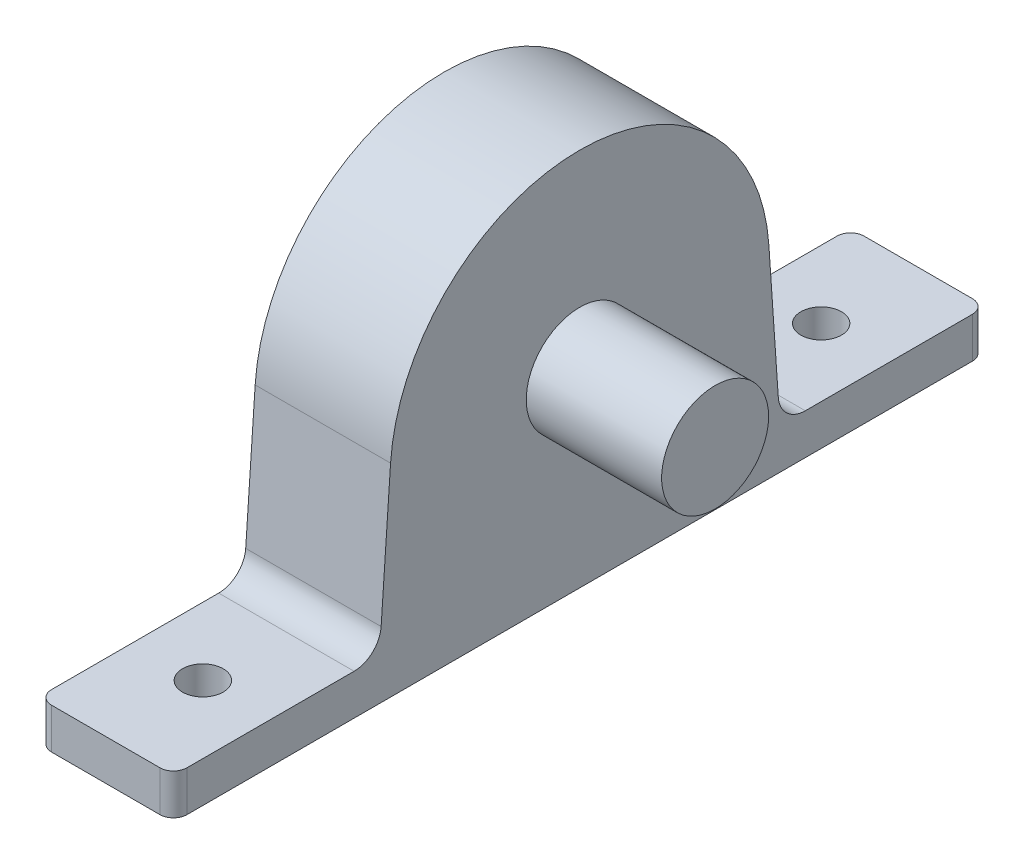
ISO-10303-21;
HEADER;
FILE_DESCRIPTION(('STEP AP214'),'2;1');
FILE_NAME('part.step','',(''),(''),'','','');
FILE_SCHEMA(('AUTOMOTIVE_DESIGN { 1 0 10303 214 1 1 1 1 }'));
ENDSEC;
DATA;
#1=APPLICATION_CONTEXT('core data for automotive mechanical design processes');
#2=APPLICATION_PROTOCOL_DEFINITION('international standard','automotive_design',2000,#1);
#3=PRODUCT_CONTEXT('',#1,'mechanical');
#4=PRODUCT('Part','Part','',(#3));
#5=PRODUCT_RELATED_PRODUCT_CATEGORY('part','',(#4));
#6=PRODUCT_DEFINITION_FORMATION('','',#4);
#7=PRODUCT_DEFINITION_CONTEXT('part definition',#1,'design');
#8=PRODUCT_DEFINITION('design','',#6,#7);
#9=PRODUCT_DEFINITION_SHAPE('','',#8);
#10=(LENGTH_UNIT() NAMED_UNIT(*) SI_UNIT(.MILLI.,.METRE.));
#11=(NAMED_UNIT(*) PLANE_ANGLE_UNIT() SI_UNIT($,.RADIAN.));
#12=(NAMED_UNIT(*) SI_UNIT($,.STERADIAN.) SOLID_ANGLE_UNIT());
#13=UNCERTAINTY_MEASURE_WITH_UNIT(LENGTH_MEASURE(1.E-05),#10,'distance_accuracy_value','');
#14=(GEOMETRIC_REPRESENTATION_CONTEXT(3) GLOBAL_UNCERTAINTY_ASSIGNED_CONTEXT((#13)) GLOBAL_UNIT_ASSIGNED_CONTEXT((#10,
#11,#12)) REPRESENTATION_CONTEXT('',''));
#15=CARTESIAN_POINT('',(0.,0.,0.));
#16=DIRECTION('',(0.,0.,1.));
#17=DIRECTION('',(1.,0.,0.));
#18=AXIS2_PLACEMENT_3D('',#15,#16,#17);
#19=CARTESIAN_POINT('',(-41.0365690573664,1.03079987136159,14.9288257231679));
#20=DIRECTION('',(0.,-0.0688836104513062,-0.997624703087886));
#21=DIRECTION('',(0.,0.997624703087886,-0.0688836104513062));
#22=AXIS2_PLACEMENT_3D('',#19,#20,#21);
#23=PLANE('',#22);
#24=DIRECTION('',(0.,0.997624703087886,-0.0688836104513062));
#25=VECTOR('',#24,1.);
#26=CARTESIAN_POINT('',(0.,1.03079987136159,14.9288257231679));
#27=LINE('',#26,#25);
#28=CARTESIAN_POINT('',(0.,4.86223277909739,14.664274403348));
#29=VERTEX_POINT('',#28);
#30=CARTESIAN_POINT('',(0.,14.9643705463183,13.9667458432304));
#31=VERTEX_POINT('',#30);
#32=EDGE_CURVE('E131',#29,#31,#27,.T.);
#33=ORIENTED_EDGE('',*,*,#32,.F.);
#34=DIRECTION('',(-1.,0.,0.));
#35=VECTOR('',#34,1.);
#36=CARTESIAN_POINT('',(10.,4.86223277909739,14.664274403348));
#37=LINE('',#36,#35);
#38=CARTESIAN_POINT('',(10.,4.86223277909739,14.664274403348));
#39=VERTEX_POINT('',#38);
#40=EDGE_CURVE('E55',#29,#39,#37,.F.);
#41=ORIENTED_EDGE('',*,*,#40,.T.);
#42=DIRECTION('',(0.,0.997624703087886,-0.0688836104513062));
#43=VECTOR('',#42,1.);
#44=CARTESIAN_POINT('',(10.,1.03079987136159,14.9288257231679));
#45=LINE('',#44,#43);
#46=CARTESIAN_POINT('',(10.,14.9643705463183,13.9667458432304));
#47=VERTEX_POINT('',#46);
#48=EDGE_CURVE('E143',#39,#47,#45,.T.);
#49=ORIENTED_EDGE('',*,*,#48,.T.);
#50=DIRECTION('',(1.,0.,0.));
#51=VECTOR('',#50,1.);
#52=CARTESIAN_POINT('',(-41.0365690573664,14.9643705463183,13.9667458432304));
#53=LINE('',#52,#51);
#54=EDGE_CURVE('E142',#31,#47,#53,.T.);
#55=ORIENTED_EDGE('',*,*,#54,.F.);
#56=EDGE_LOOP('',(#33,#41,#49,#55));
#57=FACE_BOUND('',#56,.T.);
#58=ADVANCED_FACE('F34',(#57),#23,.F.);
#59=CARTESIAN_POINT('',(-41.0365690573664,1.03079987136159,-14.9288257231679));
#60=DIRECTION('',(0.,0.068883610451306,-0.997624703087886));
#61=DIRECTION('',(0.,0.997624703087886,0.068883610451306));
#62=AXIS2_PLACEMENT_3D('',#59,#60,#61);
#63=PLANE('',#62);
#64=DIRECTION('',(0.,0.997624703087886,0.068883610451306));
#65=VECTOR('',#64,1.);
#66=CARTESIAN_POINT('',(10.,1.03079987136159,-14.9288257231679));
#67=LINE('',#66,#65);
#68=CARTESIAN_POINT('',(10.,4.86223277909739,-14.664274403348));
#69=VERTEX_POINT('',#68);
#70=CARTESIAN_POINT('',(10.,14.9643705463183,-13.9667458432304));
#71=VERTEX_POINT('',#70);
#72=EDGE_CURVE('E138',#69,#71,#67,.T.);
#73=ORIENTED_EDGE('',*,*,#72,.F.);
#74=DIRECTION('',(-1.,0.,0.));
#75=VECTOR('',#74,1.);
#76=CARTESIAN_POINT('',(-41.0365690573664,4.86223277909739,-14.664274403348));
#77=LINE('',#76,#75);
#78=CARTESIAN_POINT('',(0.,4.86223277909739,-14.664274403348));
#79=VERTEX_POINT('',#78);
#80=EDGE_CURVE('E209',#69,#79,#77,.T.);
#81=ORIENTED_EDGE('',*,*,#80,.T.);
#82=DIRECTION('',(0.,0.997624703087886,0.068883610451306));
#83=VECTOR('',#82,1.);
#84=CARTESIAN_POINT('',(0.,1.03079987136159,-14.9288257231679));
#85=LINE('',#84,#83);
#86=CARTESIAN_POINT('',(0.,14.9643705463183,-13.9667458432304));
#87=VERTEX_POINT('',#86);
#88=EDGE_CURVE('E156',#79,#87,#85,.T.);
#89=ORIENTED_EDGE('',*,*,#88,.T.);
#90=DIRECTION('',(1.,0.,0.));
#91=VECTOR('',#90,1.);
#92=CARTESIAN_POINT('',(-41.0365690573664,14.9643705463183,-13.9667458432304));
#93=LINE('',#92,#91);
#94=EDGE_CURVE('E150',#87,#71,#93,.T.);
#95=ORIENTED_EDGE('',*,*,#94,.T.);
#96=EDGE_LOOP('',(#73,#81,#89,#95));
#97=FACE_BOUND('',#96,.T.);
#98=ADVANCED_FACE('F233',(#97),#63,.T.);
#99=CARTESIAN_POINT('',(10.,0.,15.));
#100=DIRECTION('',(0.,1.,0.));
#101=DIRECTION('',(0.,0.,1.));
#102=AXIS2_PLACEMENT_3D('',#99,#100,#101);
#103=PLANE('',#102);
#104=CARTESIAN_POINT('',(5.,0.,-22.8297619047619));
#105=DIRECTION('',(0.,1.,0.));
#106=DIRECTION('',(0.,0.,1.));
#107=AXIS2_PLACEMENT_3D('',#104,#105,#106);
#108=CIRCLE('',#107,1.5);
#109=CARTESIAN_POINT('',(5.,0.,-21.3297619047619));
#110=VERTEX_POINT('',#109);
#111=EDGE_CURVE('E260',#110,#110,#108,.T.);
#112=ORIENTED_EDGE('',*,*,#111,.T.);
#113=EDGE_LOOP('',(#112));
#114=FACE_BOUND('',#113,.T.);
#115=CARTESIAN_POINT('',(5.,0.,22.8297619047619));
#116=DIRECTION('',(0.,1.,0.));
#117=DIRECTION('',(0.,0.,1.));
#118=AXIS2_PLACEMENT_3D('',#115,#116,#117);
#119=CIRCLE('',#118,1.5);
#120=CARTESIAN_POINT('',(5.,0.,24.3297619047619));
#121=VERTEX_POINT('',#120);
#122=EDGE_CURVE('E270',#121,#121,#119,.T.);
#123=ORIENTED_EDGE('',*,*,#122,.T.);
#124=EDGE_LOOP('',(#123));
#125=FACE_BOUND('',#124,.T.);
#126=DIRECTION('',(0.,0.,-1.));
#127=VECTOR('',#126,1.);
#128=CARTESIAN_POINT('',(0.,0.,15.));
#129=LINE('',#128,#127);
#130=CARTESIAN_POINT('',(0.,0.,29.));
#131=VERTEX_POINT('',#130);
#132=CARTESIAN_POINT('',(0.,0.,-29.));
#133=VERTEX_POINT('',#132);
#134=EDGE_CURVE('E162',#131,#133,#129,.T.);
#135=ORIENTED_EDGE('',*,*,#134,.T.);
#136=CARTESIAN_POINT('',(1.,0.,-29.));
#137=DIRECTION('',(0.,1.,0.));
#138=DIRECTION('',(0.,0.,1.));
#139=AXIS2_PLACEMENT_3D('',#136,#137,#138);
#140=CIRCLE('',#139,1.);
#141=CARTESIAN_POINT('',(1.,0.,-30.));
#142=VERTEX_POINT('',#141);
#143=EDGE_CURVE('E182',#133,#142,#140,.F.);
#144=ORIENTED_EDGE('',*,*,#143,.T.);
#145=DIRECTION('',(1.,0.,0.));
#146=VECTOR('',#145,1.);
#147=CARTESIAN_POINT('',(0.,0.,-30.));
#148=LINE('',#147,#146);
#149=CARTESIAN_POINT('',(9.,0.,-30.));
#150=VERTEX_POINT('',#149);
#151=EDGE_CURVE('E247',#142,#150,#148,.T.);
#152=ORIENTED_EDGE('',*,*,#151,.T.);
#153=CARTESIAN_POINT('',(9.,0.,-29.));
#154=DIRECTION('',(0.,1.,0.));
#155=DIRECTION('',(0.,0.,1.));
#156=AXIS2_PLACEMENT_3D('',#153,#154,#155);
#157=CIRCLE('',#156,1.);
#158=CARTESIAN_POINT('',(10.,0.,-29.));
#159=VERTEX_POINT('',#158);
#160=EDGE_CURVE('E176',#150,#159,#157,.F.);
#161=ORIENTED_EDGE('',*,*,#160,.T.);
#162=DIRECTION('',(0.,0.,-1.));
#163=VECTOR('',#162,1.);
#164=CARTESIAN_POINT('',(10.,0.,15.));
#165=LINE('',#164,#163);
#166=CARTESIAN_POINT('',(10.,0.,29.));
#167=VERTEX_POINT('',#166);
#168=EDGE_CURVE('E167',#167,#159,#165,.T.);
#169=ORIENTED_EDGE('',*,*,#168,.F.);
#170=CARTESIAN_POINT('',(9.,0.,29.));
#171=DIRECTION('',(0.,1.,0.));
#172=DIRECTION('',(0.,0.,1.));
#173=AXIS2_PLACEMENT_3D('',#170,#171,#172);
#174=CIRCLE('',#173,1.);
#175=CARTESIAN_POINT('',(9.,0.,30.));
#176=VERTEX_POINT('',#175);
#177=EDGE_CURVE('E178',#167,#176,#174,.F.);
#178=ORIENTED_EDGE('',*,*,#177,.T.);
#179=DIRECTION('',(-1.,0.,0.));
#180=VECTOR('',#179,1.);
#181=CARTESIAN_POINT('',(0.,0.,30.));
#182=LINE('',#181,#180);
#183=CARTESIAN_POINT('',(1.,0.,30.));
#184=VERTEX_POINT('',#183);
#185=EDGE_CURVE('E243',#176,#184,#182,.T.);
#186=ORIENTED_EDGE('',*,*,#185,.T.);
#187=CARTESIAN_POINT('',(1.,0.,29.));
#188=DIRECTION('',(0.,1.,0.));
#189=DIRECTION('',(0.,0.,1.));
#190=AXIS2_PLACEMENT_3D('',#187,#188,#189);
#191=CIRCLE('',#190,1.);
#192=EDGE_CURVE('E180',#184,#131,#191,.F.);
#193=ORIENTED_EDGE('',*,*,#192,.T.);
#194=EDGE_LOOP('',(#135,#144,#152,#161,#169,#178,#186,#193));
#195=FACE_BOUND('',#194,.T.);
#196=ADVANCED_FACE('F307',(#114,#125,#195),#103,.F.);
#197=CARTESIAN_POINT('',(10.,14.,0.));
#198=DIRECTION('',(-1.,0.,0.));
#199=DIRECTION('',(0.,0.,1.));
#200=AXIS2_PLACEMENT_3D('',#197,#198,#199);
#201=PLANE('',#200);
#202=ORIENTED_EDGE('',*,*,#48,.F.);
#203=CARTESIAN_POINT('',(10.,5.,16.6595238095238));
#204=DIRECTION('',(-1.,0.,0.));
#205=DIRECTION('',(0.,0.,1.));
#206=AXIS2_PLACEMENT_3D('',#203,#204,#205);
#207=CIRCLE('',#206,2.);
#208=CARTESIAN_POINT('',(10.,3.,16.6595238095238));
#209=VERTEX_POINT('',#208);
#210=EDGE_CURVE('E11',#39,#209,#207,.T.);
#211=ORIENTED_EDGE('',*,*,#210,.T.);
#212=DIRECTION('',(0.,0.,1.));
#213=VECTOR('',#212,1.);
#214=CARTESIAN_POINT('',(10.,3.,30.));
#215=LINE('',#214,#213);
#216=CARTESIAN_POINT('',(10.,3.,29.));
#217=VERTEX_POINT('',#216);
#218=EDGE_CURVE('E255',#209,#217,#215,.T.);
#219=ORIENTED_EDGE('',*,*,#218,.T.);
#220=DIRECTION('',(0.,-1.,0.));
#221=VECTOR('',#220,1.);
#222=CARTESIAN_POINT('',(10.,0.,29.));
#223=LINE('',#222,#221);
#224=EDGE_CURVE('E206',#217,#167,#223,.T.);
#225=ORIENTED_EDGE('',*,*,#224,.T.);
#226=ORIENTED_EDGE('',*,*,#168,.T.);
#227=DIRECTION('',(0.,-1.,0.));
#228=VECTOR('',#227,1.);
#229=CARTESIAN_POINT('',(10.,3.,-29.));
#230=LINE('',#229,#228);
#231=CARTESIAN_POINT('',(10.,3.,-29.));
#232=VERTEX_POINT('',#231);
#233=EDGE_CURVE('E204',#159,#232,#230,.F.);
#234=ORIENTED_EDGE('',*,*,#233,.T.);
#235=CARTESIAN_POINT('',(10.,3.,-16.6595238095238));
#236=VERTEX_POINT('',#235);
#237=EDGE_CURVE('E228',#232,#236,#215,.T.);
#238=ORIENTED_EDGE('',*,*,#237,.T.);
#239=CARTESIAN_POINT('',(10.,5.,-16.6595238095238));
#240=DIRECTION('',(-1.,0.,0.));
#241=DIRECTION('',(0.,0.,1.));
#242=AXIS2_PLACEMENT_3D('',#239,#240,#241);
#243=CIRCLE('',#242,2.);
#244=EDGE_CURVE('E220',#236,#69,#243,.T.);
#245=ORIENTED_EDGE('',*,*,#244,.T.);
#246=ORIENTED_EDGE('',*,*,#72,.T.);
#247=CARTESIAN_POINT('',(10.,14.,0.));
#248=DIRECTION('',(1.,0.,0.));
#249=DIRECTION('',(0.,0.,-1.));
#250=AXIS2_PLACEMENT_3D('',#247,#248,#249);
#251=CIRCLE('',#250,14.);
#252=EDGE_CURVE('E151',#71,#47,#251,.T.);
#253=ORIENTED_EDGE('',*,*,#252,.T.);
#254=EDGE_LOOP('',(#202,#211,#219,#225,#226,#234,#238,#245,#246,#253));
#255=FACE_BOUND('',#254,.T.);
#256=CARTESIAN_POINT('',(10.,14.,0.));
#257=DIRECTION('',(1.,0.,0.));
#258=DIRECTION('',(0.,0.,-1.));
#259=AXIS2_PLACEMENT_3D('',#256,#257,#258);
#260=CIRCLE('',#259,3.95);
#261=CARTESIAN_POINT('',(10.,14.,-3.95));
#262=VERTEX_POINT('',#261);
#263=EDGE_CURVE('E163',#262,#262,#260,.T.);
#264=ORIENTED_EDGE('',*,*,#263,.F.);
#265=EDGE_LOOP('',(#264));
#266=FACE_BOUND('',#265,.T.);
#267=ADVANCED_FACE('F225',(#255,#266),#201,.F.);
#268=CARTESIAN_POINT('',(0.,14.,0.));
#269=DIRECTION('',(-1.,0.,0.));
#270=DIRECTION('',(0.,0.,1.));
#271=AXIS2_PLACEMENT_3D('',#268,#269,#270);
#272=PLANE('',#271);
#273=ORIENTED_EDGE('',*,*,#88,.F.);
#274=CARTESIAN_POINT('',(0.,5.,-16.6595238095238));
#275=DIRECTION('',(-1.,0.,0.));
#276=DIRECTION('',(0.,0.,1.));
#277=AXIS2_PLACEMENT_3D('',#274,#275,#276);
#278=CIRCLE('',#277,2.);
#279=CARTESIAN_POINT('',(0.,3.,-16.6595238095238));
#280=VERTEX_POINT('',#279);
#281=EDGE_CURVE('E218',#79,#280,#278,.F.);
#282=ORIENTED_EDGE('',*,*,#281,.T.);
#283=DIRECTION('',(0.,0.,-1.));
#284=VECTOR('',#283,1.);
#285=CARTESIAN_POINT('',(0.,3.,30.));
#286=LINE('',#285,#284);
#287=CARTESIAN_POINT('',(0.,3.,-29.));
#288=VERTEX_POINT('',#287);
#289=EDGE_CURVE('E236',#280,#288,#286,.T.);
#290=ORIENTED_EDGE('',*,*,#289,.T.);
#291=DIRECTION('',(0.,-1.,0.));
#292=VECTOR('',#291,1.);
#293=CARTESIAN_POINT('',(0.,14.,-29.));
#294=LINE('',#293,#292);
#295=EDGE_CURVE('E173',#288,#133,#294,.T.);
#296=ORIENTED_EDGE('',*,*,#295,.T.);
#297=ORIENTED_EDGE('',*,*,#134,.F.);
#298=DIRECTION('',(0.,-1.,0.));
#299=VECTOR('',#298,1.);
#300=CARTESIAN_POINT('',(0.,14.,29.));
#301=LINE('',#300,#299);
#302=CARTESIAN_POINT('',(0.,3.,29.));
#303=VERTEX_POINT('',#302);
#304=EDGE_CURVE('E166',#131,#303,#301,.F.);
#305=ORIENTED_EDGE('',*,*,#304,.T.);
#306=CARTESIAN_POINT('',(0.,3.,16.6595238095238));
#307=VERTEX_POINT('',#306);
#308=EDGE_CURVE('E242',#303,#307,#286,.T.);
#309=ORIENTED_EDGE('',*,*,#308,.T.);
#310=CARTESIAN_POINT('',(0.,5.,16.6595238095238));
#311=DIRECTION('',(-1.,0.,0.));
#312=DIRECTION('',(0.,0.,1.));
#313=AXIS2_PLACEMENT_3D('',#310,#311,#312);
#314=CIRCLE('',#313,2.);
#315=EDGE_CURVE('E42',#307,#29,#314,.F.);
#316=ORIENTED_EDGE('',*,*,#315,.T.);
#317=ORIENTED_EDGE('',*,*,#32,.T.);
#318=CARTESIAN_POINT('',(0.,14.,0.));
#319=DIRECTION('',(-1.,0.,0.));
#320=DIRECTION('',(0.,0.,1.));
#321=AXIS2_PLACEMENT_3D('',#318,#319,#320);
#322=CIRCLE('',#321,14.);
#323=EDGE_CURVE('E136',#87,#31,#322,.F.);
#324=ORIENTED_EDGE('',*,*,#323,.F.);
#325=EDGE_LOOP('',(#273,#282,#290,#296,#297,#305,#309,#316,#317,#324));
#326=FACE_BOUND('',#325,.T.);
#327=ADVANCED_FACE('F134',(#326),#272,.T.);
#328=CARTESIAN_POINT('',(20.,14.,0.));
#329=DIRECTION('',(-1.,0.,0.));
#330=DIRECTION('',(0.,0.,1.));
#331=AXIS2_PLACEMENT_3D('',#328,#329,#330);
#332=CYLINDRICAL_SURFACE('',#331,3.95);
#333=CARTESIAN_POINT('',(20.,14.,0.));
#334=DIRECTION('',(1.,0.,0.));
#335=DIRECTION('',(0.,0.,-1.));
#336=AXIS2_PLACEMENT_3D('',#333,#334,#335);
#337=CIRCLE('',#336,3.95);
#338=CARTESIAN_POINT('',(20.,14.,-3.95));
#339=VERTEX_POINT('',#338);
#340=EDGE_CURVE('E159',#339,#339,#337,.T.);
#341=ORIENTED_EDGE('',*,*,#340,.F.);
#342=EDGE_LOOP('',(#341));
#343=FACE_BOUND('',#342,.T.);
#344=ORIENTED_EDGE('',*,*,#263,.T.);
#345=EDGE_LOOP('',(#344));
#346=FACE_BOUND('',#345,.T.);
#347=ADVANCED_FACE('F317',(#343,#346),#332,.T.);
#348=CARTESIAN_POINT('',(20.,14.,0.));
#349=DIRECTION('',(1.,0.,0.));
#350=DIRECTION('',(0.,0.,-1.));
#351=AXIS2_PLACEMENT_3D('',#348,#349,#350);
#352=PLANE('',#351);
#353=ORIENTED_EDGE('',*,*,#340,.T.);
#354=EDGE_LOOP('',(#353));
#355=FACE_BOUND('',#354,.T.);
#356=ADVANCED_FACE('F314',(#355),#352,.T.);
#357=CARTESIAN_POINT('',(-41.0365690573664,14.,0.));
#358=DIRECTION('',(1.,0.,0.));
#359=DIRECTION('',(0.,0.,-1.));
#360=AXIS2_PLACEMENT_3D('',#357,#358,#359);
#361=CYLINDRICAL_SURFACE('',#360,14.);
#362=ORIENTED_EDGE('',*,*,#94,.F.);
#363=ORIENTED_EDGE('',*,*,#323,.T.);
#364=ORIENTED_EDGE('',*,*,#54,.T.);
#365=ORIENTED_EDGE('',*,*,#252,.F.);
#366=EDGE_LOOP('',(#362,#363,#364,#365));
#367=FACE_BOUND('',#366,.T.);
#368=ADVANCED_FACE('F148',(#367),#361,.T.);
#369=CARTESIAN_POINT('',(0.,3.,-30.));
#370=DIRECTION('',(0.,0.,-1.));
#371=DIRECTION('',(-1.,0.,0.));
#372=AXIS2_PLACEMENT_3D('',#369,#370,#371);
#373=PLANE('',#372);
#374=ORIENTED_EDGE('',*,*,#151,.F.);
#375=DIRECTION('',(0.,-1.,0.));
#376=VECTOR('',#375,1.);
#377=CARTESIAN_POINT('',(1.,3.,-30.));
#378=LINE('',#377,#376);
#379=CARTESIAN_POINT('',(1.,3.,-30.));
#380=VERTEX_POINT('',#379);
#381=EDGE_CURVE('E187',#142,#380,#378,.F.);
#382=ORIENTED_EDGE('',*,*,#381,.T.);
#383=DIRECTION('',(1.,0.,0.));
#384=VECTOR('',#383,1.);
#385=CARTESIAN_POINT('',(0.,3.,-30.));
#386=LINE('',#385,#384);
#387=CARTESIAN_POINT('',(9.,3.,-30.));
#388=VERTEX_POINT('',#387);
#389=EDGE_CURVE('E245',#380,#388,#386,.T.);
#390=ORIENTED_EDGE('',*,*,#389,.T.);
#391=DIRECTION('',(0.,-1.,0.));
#392=VECTOR('',#391,1.);
#393=CARTESIAN_POINT('',(9.,0.,-30.));
#394=LINE('',#393,#392);
#395=EDGE_CURVE('E184',#388,#150,#394,.T.);
#396=ORIENTED_EDGE('',*,*,#395,.T.);
#397=EDGE_LOOP('',(#374,#382,#390,#396));
#398=FACE_BOUND('',#397,.T.);
#399=ADVANCED_FACE('F313',(#398),#373,.T.);
#400=CARTESIAN_POINT('',(0.,3.,0.));
#401=DIRECTION('',(0.,-1.,0.));
#402=DIRECTION('',(0.,0.,-1.));
#403=AXIS2_PLACEMENT_3D('',#400,#401,#402);
#404=PLANE('',#403);
#405=CARTESIAN_POINT('',(5.,3.,-22.8297619047619));
#406=DIRECTION('',(0.,1.,0.));
#407=DIRECTION('',(0.,0.,1.));
#408=AXIS2_PLACEMENT_3D('',#405,#406,#407);
#409=CIRCLE('',#408,1.5);
#410=CARTESIAN_POINT('',(5.,3.,-21.3297619047619));
#411=VERTEX_POINT('',#410);
#412=EDGE_CURVE('E265',#411,#411,#409,.T.);
#413=ORIENTED_EDGE('',*,*,#412,.F.);
#414=EDGE_LOOP('',(#413));
#415=FACE_BOUND('',#414,.T.);
#416=ORIENTED_EDGE('',*,*,#289,.F.);
#417=DIRECTION('',(-1.,0.,0.));
#418=VECTOR('',#417,1.);
#419=CARTESIAN_POINT('',(0.,3.,-16.6595238095238));
#420=LINE('',#419,#418);
#421=EDGE_CURVE('E212',#280,#236,#420,.F.);
#422=ORIENTED_EDGE('',*,*,#421,.T.);
#423=ORIENTED_EDGE('',*,*,#237,.F.);
#424=CARTESIAN_POINT('',(9.,3.,-29.));
#425=DIRECTION('',(0.,-1.,0.));
#426=DIRECTION('',(0.,0.,-1.));
#427=AXIS2_PLACEMENT_3D('',#424,#425,#426);
#428=CIRCLE('',#427,1.);
#429=EDGE_CURVE('E189',#232,#388,#428,.F.);
#430=ORIENTED_EDGE('',*,*,#429,.T.);
#431=ORIENTED_EDGE('',*,*,#389,.F.);
#432=CARTESIAN_POINT('',(1.,3.,-29.));
#433=DIRECTION('',(0.,-1.,0.));
#434=DIRECTION('',(0.,0.,-1.));
#435=AXIS2_PLACEMENT_3D('',#432,#433,#434);
#436=CIRCLE('',#435,1.);
#437=EDGE_CURVE('E191',#380,#288,#436,.F.);
#438=ORIENTED_EDGE('',*,*,#437,.T.);
#439=EDGE_LOOP('',(#416,#422,#423,#430,#431,#438));
#440=FACE_BOUND('',#439,.T.);
#441=ADVANCED_FACE('F238',(#415,#440),#404,.F.);
#442=CARTESIAN_POINT('',(5.,3.,22.8297619047619));
#443=DIRECTION('',(0.,1.,0.));
#444=DIRECTION('',(0.,0.,1.));
#445=AXIS2_PLACEMENT_3D('',#442,#443,#444);
#446=CIRCLE('',#445,1.5);
#447=CARTESIAN_POINT('',(5.,3.,24.3297619047619));
#448=VERTEX_POINT('',#447);
#449=EDGE_CURVE('E251',#448,#448,#446,.T.);
#450=ORIENTED_EDGE('',*,*,#449,.F.);
#451=EDGE_LOOP('',(#450));
#452=FACE_BOUND('',#451,.T.);
#453=ORIENTED_EDGE('',*,*,#218,.F.);
#454=DIRECTION('',(-1.,0.,0.));
#455=VECTOR('',#454,1.);
#456=CARTESIAN_POINT('',(0.,3.,16.6595238095238));
#457=LINE('',#456,#455);
#458=EDGE_CURVE('E214',#209,#307,#457,.T.);
#459=ORIENTED_EDGE('',*,*,#458,.T.);
#460=ORIENTED_EDGE('',*,*,#308,.F.);
#461=CARTESIAN_POINT('',(1.,3.,29.));
#462=DIRECTION('',(0.,-1.,0.));
#463=DIRECTION('',(0.,0.,-1.));
#464=AXIS2_PLACEMENT_3D('',#461,#462,#463);
#465=CIRCLE('',#464,1.);
#466=CARTESIAN_POINT('',(1.,3.,30.));
#467=VERTEX_POINT('',#466);
#468=EDGE_CURVE('E202',#303,#467,#465,.F.);
#469=ORIENTED_EDGE('',*,*,#468,.T.);
#470=DIRECTION('',(-1.,0.,0.));
#471=VECTOR('',#470,1.);
#472=CARTESIAN_POINT('',(0.,3.,30.));
#473=LINE('',#472,#471);
#474=CARTESIAN_POINT('',(9.,3.,30.));
#475=VERTEX_POINT('',#474);
#476=EDGE_CURVE('E139',#475,#467,#473,.T.);
#477=ORIENTED_EDGE('',*,*,#476,.F.);
#478=CARTESIAN_POINT('',(9.,3.,29.));
#479=DIRECTION('',(0.,-1.,0.));
#480=DIRECTION('',(0.,0.,-1.));
#481=AXIS2_PLACEMENT_3D('',#478,#479,#480);
#482=CIRCLE('',#481,1.);
#483=EDGE_CURVE('E199',#475,#217,#482,.F.);
#484=ORIENTED_EDGE('',*,*,#483,.T.);
#485=EDGE_LOOP('',(#453,#459,#460,#469,#477,#484));
#486=FACE_BOUND('',#485,.T.);
#487=ADVANCED_FACE('F280',(#452,#486),#404,.F.);
#488=CARTESIAN_POINT('',(0.,3.,30.));
#489=DIRECTION('',(0.,0.,1.));
#490=DIRECTION('',(1.,0.,0.));
#491=AXIS2_PLACEMENT_3D('',#488,#489,#490);
#492=PLANE('',#491);
#493=ORIENTED_EDGE('',*,*,#476,.T.);
#494=DIRECTION('',(0.,-1.,0.));
#495=VECTOR('',#494,1.);
#496=CARTESIAN_POINT('',(1.,3.,30.));
#497=LINE('',#496,#495);
#498=EDGE_CURVE('E196',#467,#184,#497,.T.);
#499=ORIENTED_EDGE('',*,*,#498,.T.);
#500=ORIENTED_EDGE('',*,*,#185,.F.);
#501=DIRECTION('',(0.,-1.,0.));
#502=VECTOR('',#501,1.);
#503=CARTESIAN_POINT('',(9.,3.,30.));
#504=LINE('',#503,#502);
#505=EDGE_CURVE('E194',#176,#475,#504,.F.);
#506=ORIENTED_EDGE('',*,*,#505,.T.);
#507=EDGE_LOOP('',(#493,#499,#500,#506));
#508=FACE_BOUND('',#507,.T.);
#509=ADVANCED_FACE('F283',(#508),#492,.T.);
#510=CARTESIAN_POINT('',(1.,14.,-29.));
#511=DIRECTION('',(0.,-1.,0.));
#512=DIRECTION('',(0.,0.,-1.));
#513=AXIS2_PLACEMENT_3D('',#510,#511,#512);
#514=CYLINDRICAL_SURFACE('',#513,1.);
#515=ORIENTED_EDGE('',*,*,#437,.F.);
#516=ORIENTED_EDGE('',*,*,#381,.F.);
#517=ORIENTED_EDGE('',*,*,#143,.F.);
#518=ORIENTED_EDGE('',*,*,#295,.F.);
#519=EDGE_LOOP('',(#515,#516,#517,#518));
#520=FACE_BOUND('',#519,.T.);
#521=ADVANCED_FACE('F328',(#520),#514,.T.);
#522=CARTESIAN_POINT('',(1.,3.,29.));
#523=DIRECTION('',(0.,-1.,0.));
#524=DIRECTION('',(0.,0.,-1.));
#525=AXIS2_PLACEMENT_3D('',#522,#523,#524);
#526=CYLINDRICAL_SURFACE('',#525,1.);
#527=ORIENTED_EDGE('',*,*,#468,.F.);
#528=ORIENTED_EDGE('',*,*,#304,.F.);
#529=ORIENTED_EDGE('',*,*,#192,.F.);
#530=ORIENTED_EDGE('',*,*,#498,.F.);
#531=EDGE_LOOP('',(#527,#528,#529,#530));
#532=FACE_BOUND('',#531,.T.);
#533=ADVANCED_FACE('F331',(#532),#526,.T.);
#534=CARTESIAN_POINT('',(9.,14.,29.));
#535=DIRECTION('',(0.,1.,0.));
#536=DIRECTION('',(0.,0.,1.));
#537=AXIS2_PLACEMENT_3D('',#534,#535,#536);
#538=CYLINDRICAL_SURFACE('',#537,1.);
#539=ORIENTED_EDGE('',*,*,#483,.F.);
#540=ORIENTED_EDGE('',*,*,#505,.F.);
#541=ORIENTED_EDGE('',*,*,#177,.F.);
#542=ORIENTED_EDGE('',*,*,#224,.F.);
#543=EDGE_LOOP('',(#539,#540,#541,#542));
#544=FACE_BOUND('',#543,.T.);
#545=ADVANCED_FACE('F335',(#544),#538,.T.);
#546=CARTESIAN_POINT('',(9.,3.,-29.));
#547=DIRECTION('',(0.,1.,0.));
#548=DIRECTION('',(0.,0.,1.));
#549=AXIS2_PLACEMENT_3D('',#546,#547,#548);
#550=CYLINDRICAL_SURFACE('',#549,1.);
#551=ORIENTED_EDGE('',*,*,#429,.F.);
#552=ORIENTED_EDGE('',*,*,#233,.F.);
#553=ORIENTED_EDGE('',*,*,#160,.F.);
#554=ORIENTED_EDGE('',*,*,#395,.F.);
#555=EDGE_LOOP('',(#551,#552,#553,#554));
#556=FACE_BOUND('',#555,.T.);
#557=ADVANCED_FACE('F301',(#556),#550,.T.);
#558=CARTESIAN_POINT('',(-41.0365690573664,5.,-16.6595238095238));
#559=DIRECTION('',(-1.,0.,0.));
#560=DIRECTION('',(0.,0.,1.));
#561=AXIS2_PLACEMENT_3D('',#558,#559,#560);
#562=CYLINDRICAL_SURFACE('',#561,2.);
#563=ORIENTED_EDGE('',*,*,#244,.F.);
#564=ORIENTED_EDGE('',*,*,#421,.F.);
#565=ORIENTED_EDGE('',*,*,#281,.F.);
#566=ORIENTED_EDGE('',*,*,#80,.F.);
#567=EDGE_LOOP('',(#563,#564,#565,#566));
#568=FACE_BOUND('',#567,.T.);
#569=ADVANCED_FACE('F234',(#568),#562,.F.);
#570=CARTESIAN_POINT('',(0.,5.,16.6595238095238));
#571=DIRECTION('',(1.,0.,0.));
#572=DIRECTION('',(0.,0.,-1.));
#573=AXIS2_PLACEMENT_3D('',#570,#571,#572);
#574=CYLINDRICAL_SURFACE('',#573,2.);
#575=ORIENTED_EDGE('',*,*,#210,.F.);
#576=ORIENTED_EDGE('',*,*,#40,.F.);
#577=ORIENTED_EDGE('',*,*,#315,.F.);
#578=ORIENTED_EDGE('',*,*,#458,.F.);
#579=EDGE_LOOP('',(#575,#576,#577,#578));
#580=FACE_BOUND('',#579,.T.);
#581=ADVANCED_FACE('F36',(#580),#574,.F.);
#582=CARTESIAN_POINT('',(5.,0.,22.8297619047619));
#583=DIRECTION('',(0.,1.,0.));
#584=DIRECTION('',(0.,0.,1.));
#585=AXIS2_PLACEMENT_3D('',#582,#583,#584);
#586=CYLINDRICAL_SURFACE('',#585,1.5);
#587=ORIENTED_EDGE('',*,*,#122,.F.);
#588=EDGE_LOOP('',(#587));
#589=FACE_BOUND('',#588,.T.);
#590=ORIENTED_EDGE('',*,*,#449,.T.);
#591=EDGE_LOOP('',(#590));
#592=FACE_BOUND('',#591,.T.);
#593=ADVANCED_FACE('F278',(#589,#592),#586,.F.);
#594=CARTESIAN_POINT('',(5.,0.,-22.8297619047619));
#595=DIRECTION('',(0.,1.,0.));
#596=DIRECTION('',(0.,0.,1.));
#597=AXIS2_PLACEMENT_3D('',#594,#595,#596);
#598=CYLINDRICAL_SURFACE('',#597,1.5);
#599=ORIENTED_EDGE('',*,*,#111,.F.);
#600=EDGE_LOOP('',(#599));
#601=FACE_BOUND('',#600,.T.);
#602=ORIENTED_EDGE('',*,*,#412,.T.);
#603=EDGE_LOOP('',(#602));
#604=FACE_BOUND('',#603,.T.);
#605=ADVANCED_FACE('F298',(#601,#604),#598,.F.);
#606=CLOSED_SHELL('',(#58,#98,#196,#267,#327,#347,#356,#368,#399,#441,#487,#509,#521,#533,#545,
#557,#569,#581,#593,#605));
#607=MANIFOLD_SOLID_BREP('B2',#606);
#608=ADVANCED_BREP_SHAPE_REPRESENTATION('',(#18,#607),#14);
#609=SHAPE_DEFINITION_REPRESENTATION(#9,#608);
ENDSEC;
END-ISO-10303-21;
